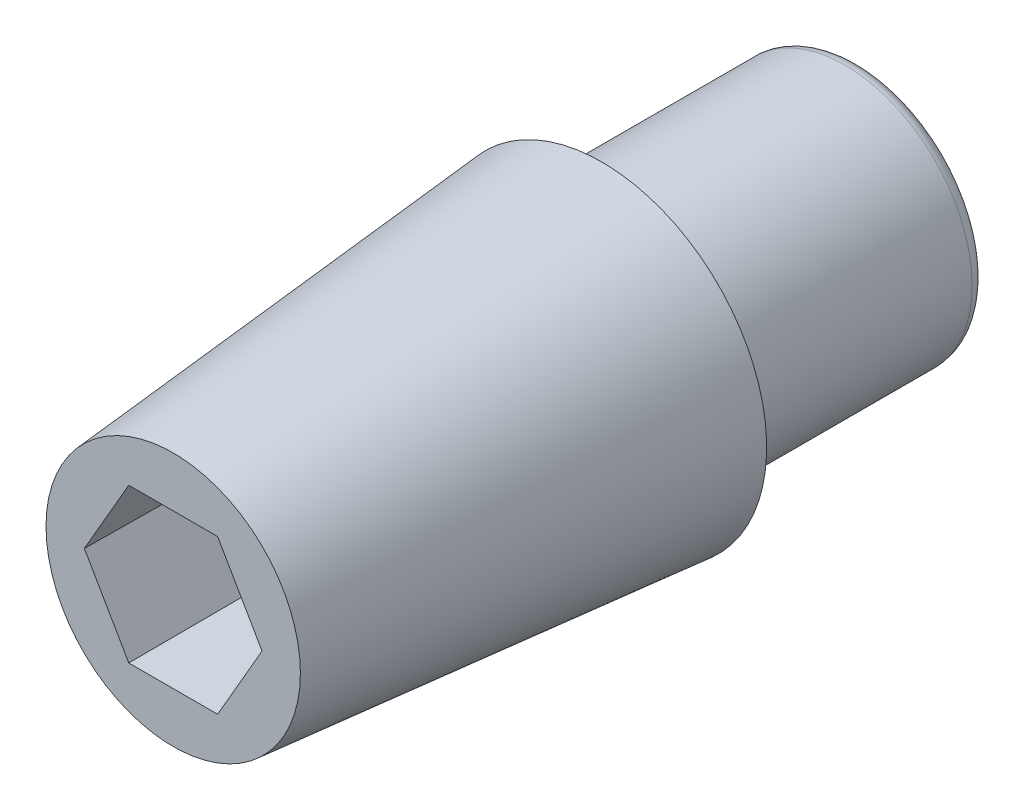
ISO-10303-21;
HEADER;
FILE_DESCRIPTION(('STEP AP214'),'2;1');
FILE_NAME('part.step','',(''),(''),'','','');
FILE_SCHEMA(('AUTOMOTIVE_DESIGN { 1 0 10303 214 1 1 1 1 }'));
ENDSEC;
DATA;
#1=APPLICATION_CONTEXT('core data for automotive mechanical design processes');
#2=APPLICATION_PROTOCOL_DEFINITION('international standard','automotive_design',2000,#1);
#3=PRODUCT_CONTEXT('',#1,'mechanical');
#4=PRODUCT('Part','Part','',(#3));
#5=PRODUCT_RELATED_PRODUCT_CATEGORY('part','',(#4));
#6=PRODUCT_DEFINITION_FORMATION('','',#4);
#7=PRODUCT_DEFINITION_CONTEXT('part definition',#1,'design');
#8=PRODUCT_DEFINITION('design','',#6,#7);
#9=PRODUCT_DEFINITION_SHAPE('','',#8);
#10=(LENGTH_UNIT() NAMED_UNIT(*) SI_UNIT(.MILLI.,.METRE.));
#11=(NAMED_UNIT(*) PLANE_ANGLE_UNIT() SI_UNIT($,.RADIAN.));
#12=(NAMED_UNIT(*) SI_UNIT($,.STERADIAN.) SOLID_ANGLE_UNIT());
#13=UNCERTAINTY_MEASURE_WITH_UNIT(LENGTH_MEASURE(1.E-05),#10,'distance_accuracy_value','');
#14=(GEOMETRIC_REPRESENTATION_CONTEXT(3) GLOBAL_UNCERTAINTY_ASSIGNED_CONTEXT((#13)) GLOBAL_UNIT_ASSIGNED_CONTEXT((#10,
#11,#12)) REPRESENTATION_CONTEXT('',''));
#15=CARTESIAN_POINT('',(0.,0.,0.));
#16=DIRECTION('',(0.,0.,1.));
#17=DIRECTION('',(1.,0.,0.));
#18=AXIS2_PLACEMENT_3D('',#15,#16,#17);
#19=CARTESIAN_POINT('',(-0.250000000000002,0.,-6.75));
#20=DIRECTION('',(0.,0.,1.));
#21=DIRECTION('',(1.,0.,0.));
#22=AXIS2_PLACEMENT_3D('',#19,#20,#21);
#23=PLANE('',#22);
#24=CARTESIAN_POINT('',(0.,0.,-6.75));
#25=DIRECTION('',(0.,0.,-1.));
#26=DIRECTION('',(0.,1.,0.));
#27=AXIS2_PLACEMENT_3D('',#24,#25,#26);
#28=CIRCLE('',#27,0.386494716716777);
#29=CARTESIAN_POINT('',(0.,0.386494716716777,-6.75));
#30=VERTEX_POINT('',#29);
#31=EDGE_CURVE('E21',#30,#30,#28,.T.);
#32=ORIENTED_EDGE('',*,*,#31,.F.);
#33=EDGE_LOOP('',(#32));
#34=FACE_BOUND('',#33,.T.);
#35=ADVANCED_FACE('F17',(#34),#23,.T.);
#36=CARTESIAN_POINT('',(0.,0.,-6.85));
#37=DIRECTION('',(0.,0.,-1.));
#38=DIRECTION('',(0.,1.,0.));
#39=AXIS2_PLACEMENT_3D('',#36,#37,#38);
#40=TOROIDAL_SURFACE('',#39,0.386494716716777,0.100000000000001);
#41=ORIENTED_EDGE('',*,*,#31,.T.);
#42=EDGE_LOOP('',(#41));
#43=FACE_BOUND('',#42,.T.);
#44=CARTESIAN_POINT('',(0.,0.,-6.84128442571819));
#45=DIRECTION('',(0.,0.,-1.));
#46=DIRECTION('',(-1.,0.,0.));
#47=AXIS2_PLACEMENT_3D('',#44,#45,#46);
#48=CIRCLE('',#47,0.486114186543316);
#49=CARTESIAN_POINT('',(-0.486114186543318,0.,-6.84128442571819));
#50=VERTEX_POINT('',#49);
#51=EDGE_CURVE('E107',#50,#50,#48,.T.);
#52=ORIENTED_EDGE('',*,*,#51,.F.);
#53=EDGE_LOOP('',(#52));
#54=FACE_BOUND('',#53,.T.);
#55=ADVANCED_FACE('F132',(#43,#54),#40,.T.);
#56=CARTESIAN_POINT('',(0.,0.,-6.90871557429773));
#57=DIRECTION('',(0.,0.,-1.));
#58=DIRECTION('',(0.,1.,0.));
#59=AXIS2_PLACEMENT_3D('',#56,#57,#58);
#60=CONICAL_SURFACE('',#59,0.492013647608756,0.087266462543748);
#61=ORIENTED_EDGE('',*,*,#51,.T.);
#62=EDGE_LOOP('',(#61));
#63=FACE_BOUND('',#62,.T.);
#64=CARTESIAN_POINT('',(0.,0.,-6.90871557427476));
#65=DIRECTION('',(0.,0.,1.));
#66=DIRECTION('',(1.,0.,0.));
#67=AXIS2_PLACEMENT_3D('',#64,#65,#66);
#68=CIRCLE('',#67,0.492013647592567);
#69=CARTESIAN_POINT('',(0.492013647592565,0.,-6.90871557427476));
#70=VERTEX_POINT('',#69);
#71=EDGE_CURVE('E103',#70,#70,#68,.T.);
#72=ORIENTED_EDGE('',*,*,#71,.T.);
#73=EDGE_LOOP('',(#72));
#74=FACE_BOUND('',#73,.T.);
#75=ADVANCED_FACE('F123',(#63,#74),#60,.T.);
#76=CARTESIAN_POINT('',(0.,0.,-6.9));
#77=DIRECTION('',(0.,0.,-1.));
#78=DIRECTION('',(-1.,0.,0.));
#79=AXIS2_PLACEMENT_3D('',#76,#77,#78);
#80=TOROIDAL_SURFACE('',#79,0.591633117401737,0.0999999999999965);
#81=ORIENTED_EDGE('',*,*,#71,.F.);
#82=EDGE_LOOP('',(#81));
#83=FACE_BOUND('',#82,.T.);
#84=CARTESIAN_POINT('',(0.,0.,-7.));
#85=DIRECTION('',(0.,0.,-1.));
#86=DIRECTION('',(-1.,0.,0.));
#87=AXIS2_PLACEMENT_3D('',#84,#85,#86);
#88=CIRCLE('',#87,0.591633117401743);
#89=CARTESIAN_POINT('',(-0.591633117401745,0.,-7.));
#90=VERTEX_POINT('',#89);
#91=EDGE_CURVE('E106',#90,#90,#88,.T.);
#92=ORIENTED_EDGE('',*,*,#91,.F.);
#93=EDGE_LOOP('',(#92));
#94=FACE_BOUND('',#93,.T.);
#95=ADVANCED_FACE('F120',(#83,#94),#80,.F.);
#96=CARTESIAN_POINT('',(2.225,0.,-9.));
#97=DIRECTION('',(0.,0.,-1.));
#98=DIRECTION('',(-1.,0.,0.));
#99=AXIS2_PLACEMENT_3D('',#96,#97,#98);
#100=PLANE('',#99);
#101=CARTESIAN_POINT('',(0.,0.,-9.));
#102=DIRECTION('',(0.,0.,1.));
#103=DIRECTION('',(0.,-1.,0.));
#104=AXIS2_PLACEMENT_3D('',#101,#102,#103);
#105=CIRCLE('',#104,3.95);
#106=CARTESIAN_POINT('',(0.,-3.95,-9.));
#107=VERTEX_POINT('',#106);
#108=EDGE_CURVE('E88',#107,#107,#105,.T.);
#109=ORIENTED_EDGE('',*,*,#108,.F.);
#110=EDGE_LOOP('',(#109));
#111=FACE_BOUND('',#110,.T.);
#112=ADVANCED_FACE('F122',(#111),#100,.T.);
#113=CARTESIAN_POINT('',(0.,0.,-7.));
#114=DIRECTION('',(0.,0.,1.));
#115=DIRECTION('',(1.,0.,0.));
#116=AXIS2_PLACEMENT_3D('',#113,#114,#115);
#117=PLANE('',#116);
#118=DIRECTION('',(-0.5,-0.866025403784439,0.));
#119=VECTOR('',#118,1.);
#120=CARTESIAN_POINT('',(-1.44337567297406,2.5,-7.));
#121=LINE('',#120,#119);
#122=CARTESIAN_POINT('',(-1.44337567297406,2.5,-7.));
#123=VERTEX_POINT('',#122);
#124=CARTESIAN_POINT('',(-2.88675134594813,0.,-7.));
#125=VERTEX_POINT('',#124);
#126=EDGE_CURVE('E329',#123,#125,#121,.T.);
#127=ORIENTED_EDGE('',*,*,#126,.T.);
#128=DIRECTION('',(0.499999999999999,-0.866025403784439,0.));
#129=VECTOR('',#128,1.);
#130=CARTESIAN_POINT('',(-2.88675134594813,0.,-7.));
#131=LINE('',#130,#129);
#132=CARTESIAN_POINT('',(-1.44337567297407,-2.5,-7.));
#133=VERTEX_POINT('',#132);
#134=EDGE_CURVE('E313',#125,#133,#131,.T.);
#135=ORIENTED_EDGE('',*,*,#134,.T.);
#136=DIRECTION('',(1.,0.,0.));
#137=VECTOR('',#136,1.);
#138=CARTESIAN_POINT('',(-1.44337567297407,-2.5,-7.));
#139=LINE('',#138,#137);
#140=CARTESIAN_POINT('',(1.44337567297406,-2.5,-7.));
#141=VERTEX_POINT('',#140);
#142=EDGE_CURVE('E308',#133,#141,#139,.T.);
#143=ORIENTED_EDGE('',*,*,#142,.T.);
#144=DIRECTION('',(0.5,0.866025403784439,0.));
#145=VECTOR('',#144,1.);
#146=CARTESIAN_POINT('',(1.44337567297406,-2.5,-7.));
#147=LINE('',#146,#145);
#148=CARTESIAN_POINT('',(2.88675134594813,0.,-7.));
#149=VERTEX_POINT('',#148);
#150=EDGE_CURVE('E69',#141,#149,#147,.T.);
#151=ORIENTED_EDGE('',*,*,#150,.T.);
#152=DIRECTION('',(-0.499999999999999,0.866025403784439,0.));
#153=VECTOR('',#152,1.);
#154=CARTESIAN_POINT('',(2.88675134594813,0.,-7.));
#155=LINE('',#154,#153);
#156=CARTESIAN_POINT('',(1.44337567297406,2.5,-7.));
#157=VERTEX_POINT('',#156);
#158=EDGE_CURVE('E71',#149,#157,#155,.T.);
#159=ORIENTED_EDGE('',*,*,#158,.T.);
#160=DIRECTION('',(1.,0.,0.));
#161=VECTOR('',#160,1.);
#162=CARTESIAN_POINT('',(1.44337567297406,2.5,-7.));
#163=LINE('',#162,#161);
#164=EDGE_CURVE('E75',#157,#123,#163,.F.);
#165=ORIENTED_EDGE('',*,*,#164,.T.);
#166=EDGE_LOOP('',(#127,#135,#143,#151,#159,#165));
#167=FACE_BOUND('',#166,.T.);
#168=ORIENTED_EDGE('',*,*,#91,.T.);
#169=EDGE_LOOP('',(#168));
#170=FACE_BOUND('',#169,.T.);
#171=ADVANCED_FACE('F73',(#167,#170),#117,.T.);
#172=CARTESIAN_POINT('',(0.,0.,-8.5));
#173=DIRECTION('',(0.,0.,1.));
#174=DIRECTION('',(0.,-1.,0.));
#175=AXIS2_PLACEMENT_3D('',#172,#173,#174);
#176=TOROIDAL_SURFACE('',#175,3.95,0.5);
#177=ORIENTED_EDGE('',*,*,#108,.T.);
#178=EDGE_LOOP('',(#177));
#179=FACE_BOUND('',#178,.T.);
#180=CARTESIAN_POINT('',(0.,0.,-8.5));
#181=DIRECTION('',(0.,0.,1.));
#182=DIRECTION('',(1.,0.,0.));
#183=AXIS2_PLACEMENT_3D('',#180,#181,#182);
#184=CIRCLE('',#183,4.45);
#185=CARTESIAN_POINT('',(4.45,0.,-8.5));
#186=VERTEX_POINT('',#185);
#187=EDGE_CURVE('E99',#186,#186,#184,.T.);
#188=ORIENTED_EDGE('',*,*,#187,.F.);
#189=EDGE_LOOP('',(#188));
#190=FACE_BOUND('',#189,.T.);
#191=ADVANCED_FACE('F19',(#179,#190),#176,.T.);
#192=CARTESIAN_POINT('',(1.44337567297406,2.5,-7.));
#193=DIRECTION('',(0.,0.999961923064171,-0.00872653549837401));
#194=DIRECTION('',(0.,0.00872653549837401,0.999961923064171));
#195=AXIS2_PLACEMENT_3D('',#192,#193,#194);
#196=PLANE('',#195);
#197=ORIENTED_EDGE('',*,*,#164,.F.);
#198=DIRECTION('',(0.00503820367424967,0.00872642474268049,0.999949231718764));
#199=VECTOR('',#198,1.);
#200=CARTESIAN_POINT('',(1.44337567297406,2.5,-7.));
#201=LINE('',#200,#199);
#202=CARTESIAN_POINT('',(1.55422178127396,2.69199109139669,15.));
#203=VERTEX_POINT('',#202);
#204=EDGE_CURVE('E80',#157,#203,#201,.T.);
#205=ORIENTED_EDGE('',*,*,#204,.T.);
#206=DIRECTION('',(1.,0.,0.));
#207=VECTOR('',#206,1.);
#208=CARTESIAN_POINT('',(2.225,2.6919910913967,15.));
#209=LINE('',#208,#207);
#210=CARTESIAN_POINT('',(-1.55422178127395,2.6919910913967,15.));
#211=VERTEX_POINT('',#210);
#212=EDGE_CURVE('E102',#211,#203,#209,.T.);
#213=ORIENTED_EDGE('',*,*,#212,.F.);
#214=DIRECTION('',(0.00503820367424958,-0.0087264247426806,-0.999949231718764));
#215=VECTOR('',#214,1.);
#216=CARTESIAN_POINT('',(-1.55422178127395,2.6919910913967,15.));
#217=LINE('',#216,#215);
#218=EDGE_CURVE('E86',#211,#123,#217,.T.);
#219=ORIENTED_EDGE('',*,*,#218,.T.);
#220=EDGE_LOOP('',(#197,#205,#213,#219));
#221=FACE_BOUND('',#220,.T.);
#222=ADVANCED_FACE('F83',(#221),#196,.F.);
#223=CARTESIAN_POINT('',(2.88675134594813,0.,-7.));
#224=DIRECTION('',(0.865992428190713,0.499980961532085,-0.008726535498374));
#225=DIRECTION('',(-0.499999999999999,0.866025403784439,0.));
#226=AXIS2_PLACEMENT_3D('',#223,#224,#225);
#227=PLANE('',#226);
#228=ORIENTED_EDGE('',*,*,#158,.F.);
#229=DIRECTION('',(0.0100764073484993,0.,0.999949231718764));
#230=VECTOR('',#229,1.);
#231=CARTESIAN_POINT('',(2.88675134594813,0.,-7.));
#232=LINE('',#231,#230);
#233=CARTESIAN_POINT('',(3.10844356254791,0.,15.));
#234=VERTEX_POINT('',#233);
#235=EDGE_CURVE('E95',#149,#234,#232,.T.);
#236=ORIENTED_EDGE('',*,*,#235,.T.);
#237=DIRECTION('',(0.499999999999999,-0.866025403784439,0.));
#238=VECTOR('',#237,1.);
#239=CARTESIAN_POINT('',(1.55422178127396,2.69199109139669,15.));
#240=LINE('',#239,#238);
#241=EDGE_CURVE('E92',#203,#234,#240,.T.);
#242=ORIENTED_EDGE('',*,*,#241,.F.);
#243=ORIENTED_EDGE('',*,*,#204,.F.);
#244=EDGE_LOOP('',(#228,#236,#242,#243));
#245=FACE_BOUND('',#244,.T.);
#246=ADVANCED_FACE('F90',(#245),#227,.F.);
#247=CARTESIAN_POINT('',(1.44337567297406,-2.5,-7.));
#248=DIRECTION('',(0.865992428190713,-0.499980961532086,-0.008726535498374));
#249=DIRECTION('',(0.5,0.866025403784439,0.));
#250=AXIS2_PLACEMENT_3D('',#247,#248,#249);
#251=PLANE('',#250);
#252=ORIENTED_EDGE('',*,*,#150,.F.);
#253=DIRECTION('',(0.00503820367424961,-0.00872642474268054,0.999949231718764));
#254=VECTOR('',#253,1.);
#255=CARTESIAN_POINT('',(1.44337567297406,-2.5,-7.));
#256=LINE('',#255,#254);
#257=CARTESIAN_POINT('',(1.55422178127395,-2.6919910913967,15.));
#258=VERTEX_POINT('',#257);
#259=EDGE_CURVE('E305',#141,#258,#256,.T.);
#260=ORIENTED_EDGE('',*,*,#259,.T.);
#261=DIRECTION('',(-0.5,-0.866025403784438,0.));
#262=VECTOR('',#261,1.);
#263=CARTESIAN_POINT('',(3.10844356254791,0.,15.));
#264=LINE('',#263,#262);
#265=EDGE_CURVE('E319',#234,#258,#264,.T.);
#266=ORIENTED_EDGE('',*,*,#265,.F.);
#267=ORIENTED_EDGE('',*,*,#235,.F.);
#268=EDGE_LOOP('',(#252,#260,#266,#267));
#269=FACE_BOUND('',#268,.T.);
#270=ADVANCED_FACE('F167',(#269),#251,.F.);
#271=CARTESIAN_POINT('',(-1.44337567297407,-2.5,-7.));
#272=DIRECTION('',(0.,-0.999961923064171,-0.00872653549837401));
#273=DIRECTION('',(0.,0.00872653549837401,-0.999961923064171));
#274=AXIS2_PLACEMENT_3D('',#271,#272,#273);
#275=PLANE('',#274);
#276=ORIENTED_EDGE('',*,*,#142,.F.);
#277=DIRECTION('',(-0.00503820367424962,-0.00872642474268057,0.999949231718764));
#278=VECTOR('',#277,1.);
#279=CARTESIAN_POINT('',(-1.44337567297407,-2.5,-7.));
#280=LINE('',#279,#278);
#281=CARTESIAN_POINT('',(-1.55422178127396,-2.69199109139669,15.));
#282=VERTEX_POINT('',#281);
#283=EDGE_CURVE('E315',#133,#282,#280,.T.);
#284=ORIENTED_EDGE('',*,*,#283,.T.);
#285=DIRECTION('',(1.,0.,0.));
#286=VECTOR('',#285,1.);
#287=CARTESIAN_POINT('',(2.225,-2.6919910913967,15.));
#288=LINE('',#287,#286);
#289=EDGE_CURVE('E311',#258,#282,#288,.F.);
#290=ORIENTED_EDGE('',*,*,#289,.F.);
#291=ORIENTED_EDGE('',*,*,#259,.F.);
#292=EDGE_LOOP('',(#276,#284,#290,#291));
#293=FACE_BOUND('',#292,.T.);
#294=ADVANCED_FACE('F164',(#293),#275,.F.);
#295=CARTESIAN_POINT('',(-2.88675134594813,0.,-7.));
#296=DIRECTION('',(-0.865992428190713,-0.499980961532085,-0.008726535498374));
#297=DIRECTION('',(0.499999999999999,-0.866025403784439,0.));
#298=AXIS2_PLACEMENT_3D('',#295,#296,#297);
#299=PLANE('',#298);
#300=ORIENTED_EDGE('',*,*,#134,.F.);
#301=DIRECTION('',(-0.0100764073484993,0.,0.999949231718764));
#302=VECTOR('',#301,1.);
#303=CARTESIAN_POINT('',(-2.88675134594813,0.,-7.));
#304=LINE('',#303,#302);
#305=CARTESIAN_POINT('',(-3.10844356254791,0.,15.));
#306=VERTEX_POINT('',#305);
#307=EDGE_CURVE('E36',#125,#306,#304,.T.);
#308=ORIENTED_EDGE('',*,*,#307,.T.);
#309=DIRECTION('',(-0.5,0.866025403784439,0.));
#310=VECTOR('',#309,1.);
#311=CARTESIAN_POINT('',(-1.55422178127396,-2.69199109139669,15.));
#312=LINE('',#311,#310);
#313=EDGE_CURVE('E331',#282,#306,#312,.T.);
#314=ORIENTED_EDGE('',*,*,#313,.F.);
#315=ORIENTED_EDGE('',*,*,#283,.F.);
#316=EDGE_LOOP('',(#300,#308,#314,#315));
#317=FACE_BOUND('',#316,.T.);
#318=ADVANCED_FACE('F160',(#317),#299,.F.);
#319=CARTESIAN_POINT('',(-1.44337567297406,2.5,-7.));
#320=DIRECTION('',(-0.865992428190713,0.499980961532086,-0.008726535498374));
#321=DIRECTION('',(-0.5,-0.866025403784439,0.));
#322=AXIS2_PLACEMENT_3D('',#319,#320,#321);
#323=PLANE('',#322);
#324=ORIENTED_EDGE('',*,*,#126,.F.);
#325=ORIENTED_EDGE('',*,*,#218,.F.);
#326=DIRECTION('',(0.5,0.866025403784438,0.));
#327=VECTOR('',#326,1.);
#328=CARTESIAN_POINT('',(-3.10844356254791,0.,15.));
#329=LINE('',#328,#327);
#330=EDGE_CURVE('E115',#306,#211,#329,.T.);
#331=ORIENTED_EDGE('',*,*,#330,.F.);
#332=ORIENTED_EDGE('',*,*,#307,.F.);
#333=EDGE_LOOP('',(#324,#325,#331,#332));
#334=FACE_BOUND('',#333,.T.);
#335=ADVANCED_FACE('F156',(#334),#323,.F.);
#336=CARTESIAN_POINT('',(0.,0.,3.));
#337=DIRECTION('',(0.,0.,1.));
#338=DIRECTION('',(1.,0.,0.));
#339=AXIS2_PLACEMENT_3D('',#336,#337,#338);
#340=CYLINDRICAL_SURFACE('',#339,4.45);
#341=ORIENTED_EDGE('',*,*,#187,.T.);
#342=EDGE_LOOP('',(#341));
#343=FACE_BOUND('',#342,.T.);
#344=CARTESIAN_POINT('',(0.,0.,0.));
#345=DIRECTION('',(0.,0.,1.));
#346=DIRECTION('',(1.,0.,0.));
#347=AXIS2_PLACEMENT_3D('',#344,#345,#346);
#348=CIRCLE('',#347,4.45);
#349=CARTESIAN_POINT('',(4.45,0.,0.));
#350=VERTEX_POINT('',#349);
#351=EDGE_CURVE('E112',#350,#350,#348,.T.);
#352=ORIENTED_EDGE('',*,*,#351,.F.);
#353=EDGE_LOOP('',(#352));
#354=FACE_BOUND('',#353,.T.);
#355=ADVANCED_FACE('F152',(#343,#354),#340,.T.);
#356=CARTESIAN_POINT('',(2.225,0.,15.));
#357=DIRECTION('',(0.,0.,1.));
#358=DIRECTION('',(1.,0.,0.));
#359=AXIS2_PLACEMENT_3D('',#356,#357,#358);
#360=PLANE('',#359);
#361=CARTESIAN_POINT('',(0.,0.,14.9999999999864));
#362=DIRECTION('',(0.,0.,-1.));
#363=DIRECTION('',(-1.,0.,0.));
#364=AXIS2_PLACEMENT_3D('',#361,#362,#363);
#365=CIRCLE('',#364,4.44999999999141);
#366=CARTESIAN_POINT('',(-4.44999999999141,0.,14.9999999999864));
#367=VERTEX_POINT('',#366);
#368=EDGE_CURVE('E27',#367,#367,#365,.T.);
#369=ORIENTED_EDGE('',*,*,#368,.F.);
#370=EDGE_LOOP('',(#369));
#371=FACE_BOUND('',#370,.T.);
#372=ORIENTED_EDGE('',*,*,#313,.T.);
#373=ORIENTED_EDGE('',*,*,#330,.T.);
#374=ORIENTED_EDGE('',*,*,#212,.T.);
#375=ORIENTED_EDGE('',*,*,#241,.T.);
#376=ORIENTED_EDGE('',*,*,#265,.T.);
#377=ORIENTED_EDGE('',*,*,#289,.T.);
#378=EDGE_LOOP('',(#372,#373,#374,#375,#376,#377));
#379=FACE_BOUND('',#378,.T.);
#380=ADVANCED_FACE('F145',(#371,#379),#360,.T.);
#381=CARTESIAN_POINT('',(4.45,0.,0.));
#382=DIRECTION('',(0.,0.,-1.));
#383=DIRECTION('',(-1.,0.,0.));
#384=AXIS2_PLACEMENT_3D('',#381,#382,#383);
#385=PLANE('',#384);
#386=CARTESIAN_POINT('',(0.,0.,-1.13686482306521E-10));
#387=DIRECTION('',(0.,0.,-1.));
#388=DIRECTION('',(-1.,0.,0.));
#389=AXIS2_PLACEMENT_3D('',#386,#387,#388);
#390=CIRCLE('',#389,5.76232995137573);
#391=CARTESIAN_POINT('',(-5.76232995137573,0.,-1.13686126891426E-10));
#392=VERTEX_POINT('',#391);
#393=EDGE_CURVE('E10',#392,#392,#390,.F.);
#394=ORIENTED_EDGE('',*,*,#393,.F.);
#395=EDGE_LOOP('',(#394));
#396=FACE_BOUND('',#395,.T.);
#397=ORIENTED_EDGE('',*,*,#351,.T.);
#398=EDGE_LOOP('',(#397));
#399=FACE_BOUND('',#398,.T.);
#400=ADVANCED_FACE('F139',(#396,#399),#385,.T.);
#401=CARTESIAN_POINT('',(0.,0.,-1.70530611997519E-10));
#402=DIRECTION('',(0.,0.,-1.));
#403=DIRECTION('',(-1.,0.,0.));
#404=AXIS2_PLACEMENT_3D('',#401,#402,#403);
#405=CONICAL_SURFACE('',#404,5.76232995138071,0.0872664624995971);
#406=ORIENTED_EDGE('',*,*,#393,.T.);
#407=EDGE_LOOP('',(#406));
#408=FACE_BOUND('',#407,.T.);
#409=ORIENTED_EDGE('',*,*,#368,.T.);
#410=EDGE_LOOP('',(#409));
#411=FACE_BOUND('',#410,.T.);
#412=ADVANCED_FACE('F137',(#408,#411),#405,.T.);
#413=CLOSED_SHELL('',(#35,#55,#75,#95,#112,#171,#191,#222,#246,#270,#294,#318,#335,#355,#380,
#400,#412));
#414=MANIFOLD_SOLID_BREP('B1',#413);
#415=ADVANCED_BREP_SHAPE_REPRESENTATION('',(#18,#414),#14);
#416=SHAPE_DEFINITION_REPRESENTATION(#9,#415);
ENDSEC;
END-ISO-10303-21;
